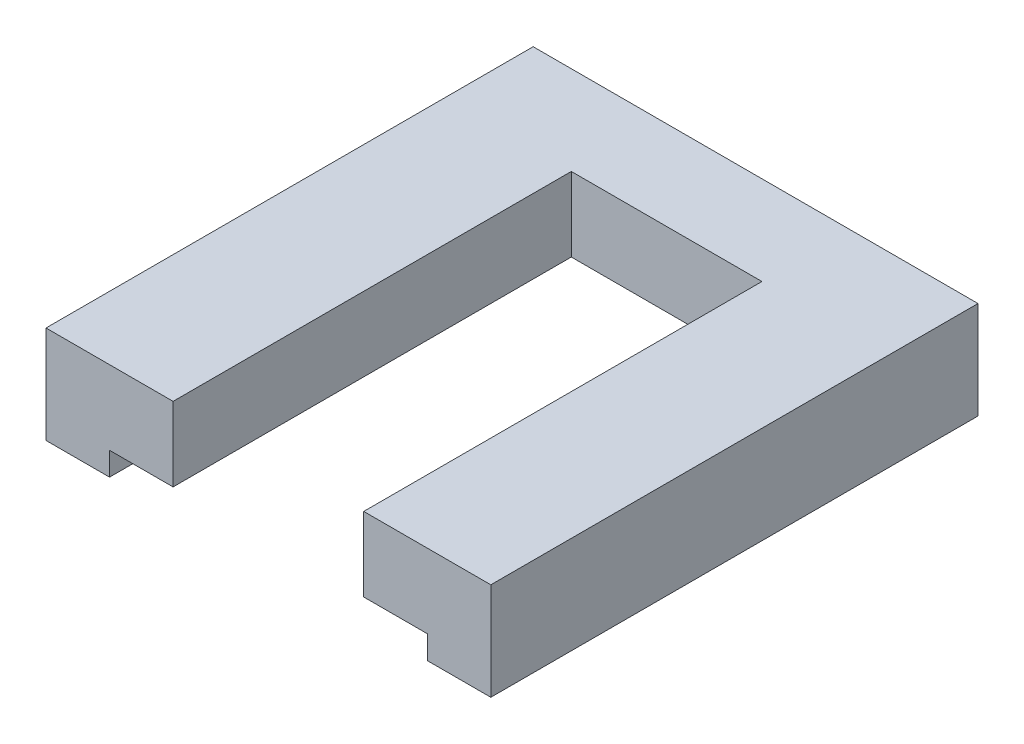
ISO-10303-21;
HEADER;
FILE_DESCRIPTION(('STEP AP214'),'2;1');
FILE_NAME('part.step','',(''),(''),'','','');
FILE_SCHEMA(('AUTOMOTIVE_DESIGN { 1 0 10303 214 1 1 1 1 }'));
ENDSEC;
DATA;
#1=APPLICATION_CONTEXT('core data for automotive mechanical design processes');
#2=APPLICATION_PROTOCOL_DEFINITION('international standard','automotive_design',2000,#1);
#3=PRODUCT_CONTEXT('',#1,'mechanical');
#4=PRODUCT('Part','Part','',(#3));
#5=PRODUCT_RELATED_PRODUCT_CATEGORY('part','',(#4));
#6=PRODUCT_DEFINITION_FORMATION('','',#4);
#7=PRODUCT_DEFINITION_CONTEXT('part definition',#1,'design');
#8=PRODUCT_DEFINITION('design','',#6,#7);
#9=PRODUCT_DEFINITION_SHAPE('','',#8);
#10=(LENGTH_UNIT() NAMED_UNIT(*) SI_UNIT(.MILLI.,.METRE.));
#11=(NAMED_UNIT(*) PLANE_ANGLE_UNIT() SI_UNIT($,.RADIAN.));
#12=(NAMED_UNIT(*) SI_UNIT($,.STERADIAN.) SOLID_ANGLE_UNIT());
#13=UNCERTAINTY_MEASURE_WITH_UNIT(LENGTH_MEASURE(1.E-05),#10,'distance_accuracy_value','');
#14=(GEOMETRIC_REPRESENTATION_CONTEXT(3) GLOBAL_UNCERTAINTY_ASSIGNED_CONTEXT((#13)) GLOBAL_UNIT_ASSIGNED_CONTEXT((#10,
#11,#12)) REPRESENTATION_CONTEXT('',''));
#15=CARTESIAN_POINT('',(0.,0.,0.));
#16=DIRECTION('',(0.,0.,1.));
#17=DIRECTION('',(1.,0.,0.));
#18=AXIS2_PLACEMENT_3D('',#15,#16,#17);
#19=CARTESIAN_POINT('',(-11.2941176470588,1.1,0.));
#20=DIRECTION('',(1.,0.,0.));
#21=DIRECTION('',(0.,0.,-1.));
#22=AXIS2_PLACEMENT_3D('',#19,#20,#21);
#23=PLANE('',#22);
#24=DIRECTION('',(0.,0.,1.));
#25=VECTOR('',#24,1.);
#26=CARTESIAN_POINT('',(-11.2941176470588,0.,0.));
#27=LINE('',#26,#25);
#28=CARTESIAN_POINT('',(-11.2941176470588,0.,-13.5));
#29=VERTEX_POINT('',#28);
#30=CARTESIAN_POINT('',(-11.2941176470588,0.,9.5));
#31=VERTEX_POINT('',#30);
#32=EDGE_CURVE('E184',#29,#31,#27,.T.);
#33=ORIENTED_EDGE('',*,*,#32,.T.);
#34=DIRECTION('',(0.,-1.,0.));
#35=VECTOR('',#34,1.);
#36=CARTESIAN_POINT('',(-11.2941176470588,1.1,9.5));
#37=LINE('',#36,#35);
#38=CARTESIAN_POINT('',(-11.2941176470588,4.6,9.5));
#39=VERTEX_POINT('',#38);
#40=EDGE_CURVE('E11',#39,#31,#37,.T.);
#41=ORIENTED_EDGE('',*,*,#40,.F.);
#42=DIRECTION('',(0.,0.,1.));
#43=VECTOR('',#42,1.);
#44=CARTESIAN_POINT('',(-11.2941176470588,4.6,-13.5));
#45=LINE('',#44,#43);
#46=CARTESIAN_POINT('',(-11.2941176470588,4.6,-13.5));
#47=VERTEX_POINT('',#46);
#48=EDGE_CURVE('E138',#47,#39,#45,.T.);
#49=ORIENTED_EDGE('',*,*,#48,.F.);
#50=DIRECTION('',(0.,-1.,0.));
#51=VECTOR('',#50,1.);
#52=CARTESIAN_POINT('',(-11.2941176470588,1.1,-13.5));
#53=LINE('',#52,#51);
#54=EDGE_CURVE('E88',#47,#29,#53,.T.);
#55=ORIENTED_EDGE('',*,*,#54,.T.);
#56=EDGE_LOOP('',(#33,#41,#49,#55));
#57=FACE_BOUND('',#56,.T.);
#58=ADVANCED_FACE('F35',(#57),#23,.F.);
#59=CARTESIAN_POINT('',(0.,1.1,9.50000000000001));
#60=DIRECTION('',(0.,0.,-1.));
#61=DIRECTION('',(-1.,0.,0.));
#62=AXIS2_PLACEMENT_3D('',#59,#60,#61);
#63=PLANE('',#62);
#64=DIRECTION('',(1.,0.,0.));
#65=VECTOR('',#64,1.);
#66=CARTESIAN_POINT('',(0.,0.,9.50000000000001));
#67=LINE('',#66,#65);
#68=CARTESIAN_POINT('',(-8.29411764705883,0.,9.5));
#69=VERTEX_POINT('',#68);
#70=EDGE_CURVE('E193',#31,#69,#67,.T.);
#71=ORIENTED_EDGE('',*,*,#70,.T.);
#72=DIRECTION('',(0.,-1.,0.));
#73=VECTOR('',#72,1.);
#74=CARTESIAN_POINT('',(-8.29411764705883,1.1,9.5));
#75=LINE('',#74,#73);
#76=CARTESIAN_POINT('',(-8.29411764705883,1.1,9.5));
#77=VERTEX_POINT('',#76);
#78=EDGE_CURVE('E43',#77,#69,#75,.T.);
#79=ORIENTED_EDGE('',*,*,#78,.F.);
#80=DIRECTION('',(1.,0.,0.));
#81=VECTOR('',#80,1.);
#82=CARTESIAN_POINT('',(-8.29411764705883,1.1,9.5));
#83=LINE('',#82,#81);
#84=CARTESIAN_POINT('',(-5.29411764705882,1.1,9.5));
#85=VERTEX_POINT('',#84);
#86=EDGE_CURVE('E165',#77,#85,#83,.T.);
#87=ORIENTED_EDGE('',*,*,#86,.T.);
#88=DIRECTION('',(0.,-1.,0.));
#89=VECTOR('',#88,1.);
#90=CARTESIAN_POINT('',(-5.29411764705882,4.6,9.5));
#91=LINE('',#90,#89);
#92=CARTESIAN_POINT('',(-5.29411764705882,4.6,9.5));
#93=VERTEX_POINT('',#92);
#94=EDGE_CURVE('E181',#93,#85,#91,.T.);
#95=ORIENTED_EDGE('',*,*,#94,.F.);
#96=DIRECTION('',(1.,0.,0.));
#97=VECTOR('',#96,1.);
#98=CARTESIAN_POINT('',(-11.2941176470588,4.6,9.5));
#99=LINE('',#98,#97);
#100=EDGE_CURVE('E141',#39,#93,#99,.T.);
#101=ORIENTED_EDGE('',*,*,#100,.F.);
#102=ORIENTED_EDGE('',*,*,#40,.T.);
#103=EDGE_LOOP('',(#71,#79,#87,#95,#101,#102));
#104=FACE_BOUND('',#103,.T.);
#105=ADVANCED_FACE('F222',(#104),#63,.F.);
#106=CARTESIAN_POINT('',(-8.29411764705883,1.1,0.));
#107=DIRECTION('',(1.,0.,0.));
#108=DIRECTION('',(0.,0.,-1.));
#109=AXIS2_PLACEMENT_3D('',#106,#107,#108);
#110=PLANE('',#109);
#111=DIRECTION('',(0.,0.,1.));
#112=VECTOR('',#111,1.);
#113=CARTESIAN_POINT('',(-8.29411764705883,0.,0.));
#114=LINE('',#113,#112);
#115=CARTESIAN_POINT('',(-8.29411764705883,0.,-10.5));
#116=VERTEX_POINT('',#115);
#117=EDGE_CURVE('E195',#116,#69,#114,.T.);
#118=ORIENTED_EDGE('',*,*,#117,.F.);
#119=DIRECTION('',(0.,-1.,0.));
#120=VECTOR('',#119,1.);
#121=CARTESIAN_POINT('',(-8.29411764705883,1.1,-10.5));
#122=LINE('',#121,#120);
#123=CARTESIAN_POINT('',(-8.29411764705883,1.1,-10.5));
#124=VERTEX_POINT('',#123);
#125=EDGE_CURVE('E216',#124,#116,#122,.T.);
#126=ORIENTED_EDGE('',*,*,#125,.F.);
#127=DIRECTION('',(0.,0.,1.));
#128=VECTOR('',#127,1.);
#129=CARTESIAN_POINT('',(-8.29411764705883,1.1,0.));
#130=LINE('',#129,#128);
#131=EDGE_CURVE('E185',#124,#77,#130,.T.);
#132=ORIENTED_EDGE('',*,*,#131,.T.);
#133=ORIENTED_EDGE('',*,*,#78,.T.);
#134=EDGE_LOOP('',(#118,#126,#132,#133));
#135=FACE_BOUND('',#134,.T.);
#136=ADVANCED_FACE('F219',(#135),#110,.T.);
#137=CARTESIAN_POINT('',(0.,1.1,-10.5));
#138=DIRECTION('',(0.,0.,-1.));
#139=DIRECTION('',(-1.,0.,0.));
#140=AXIS2_PLACEMENT_3D('',#137,#138,#139);
#141=PLANE('',#140);
#142=DIRECTION('',(1.,0.,0.));
#143=VECTOR('',#142,1.);
#144=CARTESIAN_POINT('',(0.,0.,-10.5));
#145=LINE('',#144,#143);
#146=CARTESIAN_POINT('',(6.70588235294117,0.,-10.5));
#147=VERTEX_POINT('',#146);
#148=EDGE_CURVE('E198',#116,#147,#145,.T.);
#149=ORIENTED_EDGE('',*,*,#148,.T.);
#150=DIRECTION('',(0.,-1.,0.));
#151=VECTOR('',#150,1.);
#152=CARTESIAN_POINT('',(6.70588235294117,1.1,-10.5));
#153=LINE('',#152,#151);
#154=CARTESIAN_POINT('',(6.70588235294117,1.1,-10.5));
#155=VERTEX_POINT('',#154);
#156=EDGE_CURVE('E51',#155,#147,#153,.T.);
#157=ORIENTED_EDGE('',*,*,#156,.F.);
#158=DIRECTION('',(1.,0.,0.));
#159=VECTOR('',#158,1.);
#160=CARTESIAN_POINT('',(0.,1.1,-10.5));
#161=LINE('',#160,#159);
#162=EDGE_CURVE('E187',#124,#155,#161,.T.);
#163=ORIENTED_EDGE('',*,*,#162,.F.);
#164=ORIENTED_EDGE('',*,*,#125,.T.);
#165=EDGE_LOOP('',(#149,#157,#163,#164));
#166=FACE_BOUND('',#165,.T.);
#167=ADVANCED_FACE('F228',(#166),#141,.F.);
#168=CARTESIAN_POINT('',(6.70588235294117,1.1,0.));
#169=DIRECTION('',(1.,0.,0.));
#170=DIRECTION('',(0.,0.,-1.));
#171=AXIS2_PLACEMENT_3D('',#168,#169,#170);
#172=PLANE('',#171);
#173=DIRECTION('',(0.,0.,1.));
#174=VECTOR('',#173,1.);
#175=CARTESIAN_POINT('',(6.70588235294117,0.,0.));
#176=LINE('',#175,#174);
#177=CARTESIAN_POINT('',(6.70588235294117,0.,9.5));
#178=VERTEX_POINT('',#177);
#179=EDGE_CURVE('E200',#147,#178,#176,.T.);
#180=ORIENTED_EDGE('',*,*,#179,.T.);
#181=DIRECTION('',(0.,-1.,0.));
#182=VECTOR('',#181,1.);
#183=CARTESIAN_POINT('',(6.70588235294117,1.1,9.5));
#184=LINE('',#183,#182);
#185=CARTESIAN_POINT('',(6.70588235294117,1.1,9.5));
#186=VERTEX_POINT('',#185);
#187=EDGE_CURVE('E212',#186,#178,#184,.T.);
#188=ORIENTED_EDGE('',*,*,#187,.F.);
#189=DIRECTION('',(0.,0.,1.));
#190=VECTOR('',#189,1.);
#191=CARTESIAN_POINT('',(6.70588235294117,1.1,0.));
#192=LINE('',#191,#190);
#193=EDGE_CURVE('E135',#155,#186,#192,.T.);
#194=ORIENTED_EDGE('',*,*,#193,.F.);
#195=ORIENTED_EDGE('',*,*,#156,.T.);
#196=EDGE_LOOP('',(#180,#188,#194,#195));
#197=FACE_BOUND('',#196,.T.);
#198=ADVANCED_FACE('F230',(#197),#172,.F.);
#199=CARTESIAN_POINT('',(0.,1.1,9.5));
#200=DIRECTION('',(0.,0.,-1.));
#201=DIRECTION('',(-1.,0.,0.));
#202=AXIS2_PLACEMENT_3D('',#199,#200,#201);
#203=PLANE('',#202);
#204=DIRECTION('',(1.,0.,0.));
#205=VECTOR('',#204,1.);
#206=CARTESIAN_POINT('',(0.,0.,9.5));
#207=LINE('',#206,#205);
#208=CARTESIAN_POINT('',(9.70588235294117,0.,9.5));
#209=VERTEX_POINT('',#208);
#210=EDGE_CURVE('E202',#178,#209,#207,.T.);
#211=ORIENTED_EDGE('',*,*,#210,.T.);
#212=DIRECTION('',(0.,-1.,0.));
#213=VECTOR('',#212,1.);
#214=CARTESIAN_POINT('',(9.70588235294117,1.1,9.5));
#215=LINE('',#214,#213);
#216=CARTESIAN_POINT('',(9.70588235294117,4.6,9.5));
#217=VERTEX_POINT('',#216);
#218=EDGE_CURVE('E210',#217,#209,#215,.T.);
#219=ORIENTED_EDGE('',*,*,#218,.F.);
#220=DIRECTION('',(1.,0.,0.));
#221=VECTOR('',#220,1.);
#222=CARTESIAN_POINT('',(3.70588235294118,4.6,9.5));
#223=LINE('',#222,#221);
#224=CARTESIAN_POINT('',(3.70588235294118,4.6,9.5));
#225=VERTEX_POINT('',#224);
#226=EDGE_CURVE('E161',#225,#217,#223,.T.);
#227=ORIENTED_EDGE('',*,*,#226,.F.);
#228=DIRECTION('',(0.,-1.,0.));
#229=VECTOR('',#228,1.);
#230=CARTESIAN_POINT('',(3.70588235294118,4.6,9.5));
#231=LINE('',#230,#229);
#232=CARTESIAN_POINT('',(3.70588235294118,1.1,9.5));
#233=VERTEX_POINT('',#232);
#234=EDGE_CURVE('E164',#225,#233,#231,.T.);
#235=ORIENTED_EDGE('',*,*,#234,.T.);
#236=DIRECTION('',(1.,0.,0.));
#237=VECTOR('',#236,1.);
#238=CARTESIAN_POINT('',(6.70588235294117,1.1,9.5));
#239=LINE('',#238,#237);
#240=EDGE_CURVE('E148',#233,#186,#239,.T.);
#241=ORIENTED_EDGE('',*,*,#240,.T.);
#242=ORIENTED_EDGE('',*,*,#187,.T.);
#243=EDGE_LOOP('',(#211,#219,#227,#235,#241,#242));
#244=FACE_BOUND('',#243,.T.);
#245=ADVANCED_FACE('F251',(#244),#203,.F.);
#246=CARTESIAN_POINT('',(9.70588235294117,1.1,0.));
#247=DIRECTION('',(1.,0.,0.));
#248=DIRECTION('',(0.,0.,-1.));
#249=AXIS2_PLACEMENT_3D('',#246,#247,#248);
#250=PLANE('',#249);
#251=DIRECTION('',(0.,0.,1.));
#252=VECTOR('',#251,1.);
#253=CARTESIAN_POINT('',(9.70588235294117,0.,0.));
#254=LINE('',#253,#252);
#255=CARTESIAN_POINT('',(9.70588235294117,0.,-13.5));
#256=VERTEX_POINT('',#255);
#257=EDGE_CURVE('E205',#256,#209,#254,.T.);
#258=ORIENTED_EDGE('',*,*,#257,.F.);
#259=DIRECTION('',(0.,-1.,0.));
#260=VECTOR('',#259,1.);
#261=CARTESIAN_POINT('',(9.70588235294117,1.1,-13.5));
#262=LINE('',#261,#260);
#263=CARTESIAN_POINT('',(9.70588235294117,4.6,-13.5));
#264=VERTEX_POINT('',#263);
#265=EDGE_CURVE('E81',#264,#256,#262,.T.);
#266=ORIENTED_EDGE('',*,*,#265,.F.);
#267=DIRECTION('',(0.,0.,-1.));
#268=VECTOR('',#267,1.);
#269=CARTESIAN_POINT('',(9.70588235294117,4.6,9.5));
#270=LINE('',#269,#268);
#271=EDGE_CURVE('E147',#217,#264,#270,.T.);
#272=ORIENTED_EDGE('',*,*,#271,.F.);
#273=ORIENTED_EDGE('',*,*,#218,.T.);
#274=EDGE_LOOP('',(#258,#266,#272,#273));
#275=FACE_BOUND('',#274,.T.);
#276=ADVANCED_FACE('F253',(#275),#250,.T.);
#277=CARTESIAN_POINT('',(0.,1.1,-13.5));
#278=DIRECTION('',(0.,0.,-1.));
#279=DIRECTION('',(-1.,0.,0.));
#280=AXIS2_PLACEMENT_3D('',#277,#278,#279);
#281=PLANE('',#280);
#282=DIRECTION('',(1.,0.,0.));
#283=VECTOR('',#282,1.);
#284=CARTESIAN_POINT('',(0.,0.,-13.5));
#285=LINE('',#284,#283);
#286=EDGE_CURVE('E134',#29,#256,#285,.T.);
#287=ORIENTED_EDGE('',*,*,#286,.F.);
#288=ORIENTED_EDGE('',*,*,#54,.F.);
#289=DIRECTION('',(-1.,0.,0.));
#290=VECTOR('',#289,1.);
#291=CARTESIAN_POINT('',(9.70588235294117,4.6,-13.5));
#292=LINE('',#291,#290);
#293=EDGE_CURVE('E132',#264,#47,#292,.T.);
#294=ORIENTED_EDGE('',*,*,#293,.F.);
#295=ORIENTED_EDGE('',*,*,#265,.T.);
#296=EDGE_LOOP('',(#287,#288,#294,#295));
#297=FACE_BOUND('',#296,.T.);
#298=ADVANCED_FACE('F130',(#297),#281,.T.);
#299=CARTESIAN_POINT('',(0.,0.,0.));
#300=DIRECTION('',(0.,1.,0.));
#301=DIRECTION('',(0.,0.,1.));
#302=AXIS2_PLACEMENT_3D('',#299,#300,#301);
#303=PLANE('',#302);
#304=ORIENTED_EDGE('',*,*,#32,.F.);
#305=ORIENTED_EDGE('',*,*,#286,.T.);
#306=ORIENTED_EDGE('',*,*,#257,.T.);
#307=ORIENTED_EDGE('',*,*,#210,.F.);
#308=ORIENTED_EDGE('',*,*,#179,.F.);
#309=ORIENTED_EDGE('',*,*,#148,.F.);
#310=ORIENTED_EDGE('',*,*,#117,.T.);
#311=ORIENTED_EDGE('',*,*,#70,.F.);
#312=EDGE_LOOP('',(#304,#305,#306,#307,#308,#309,#310,#311));
#313=FACE_BOUND('',#312,.T.);
#314=ADVANCED_FACE('F225',(#313),#303,.F.);
#315=CARTESIAN_POINT('',(-5.29411764705882,4.6,9.5));
#316=DIRECTION('',(-1.,0.,0.));
#317=DIRECTION('',(0.,0.,1.));
#318=AXIS2_PLACEMENT_3D('',#315,#316,#317);
#319=PLANE('',#318);
#320=DIRECTION('',(0.,0.,-1.));
#321=VECTOR('',#320,1.);
#322=CARTESIAN_POINT('',(-5.29411764705882,1.1,9.5));
#323=LINE('',#322,#321);
#324=CARTESIAN_POINT('',(-5.29411764705882,1.1,-9.3));
#325=VERTEX_POINT('',#324);
#326=EDGE_CURVE('E167',#85,#325,#323,.T.);
#327=ORIENTED_EDGE('',*,*,#326,.T.);
#328=DIRECTION('',(0.,-1.,0.));
#329=VECTOR('',#328,1.);
#330=CARTESIAN_POINT('',(-5.29411764705882,4.6,-9.3));
#331=LINE('',#330,#329);
#332=CARTESIAN_POINT('',(-5.29411764705882,4.6,-9.3));
#333=VERTEX_POINT('',#332);
#334=EDGE_CURVE('E178',#333,#325,#331,.T.);
#335=ORIENTED_EDGE('',*,*,#334,.F.);
#336=DIRECTION('',(0.,0.,-1.));
#337=VECTOR('',#336,1.);
#338=CARTESIAN_POINT('',(-5.29411764705882,4.6,9.5));
#339=LINE('',#338,#337);
#340=EDGE_CURVE('E155',#93,#333,#339,.T.);
#341=ORIENTED_EDGE('',*,*,#340,.F.);
#342=ORIENTED_EDGE('',*,*,#94,.T.);
#343=EDGE_LOOP('',(#327,#335,#341,#342));
#344=FACE_BOUND('',#343,.T.);
#345=ADVANCED_FACE('F238',(#344),#319,.F.);
#346=CARTESIAN_POINT('',(-5.29411764705882,4.6,-9.3));
#347=DIRECTION('',(0.,0.,-1.));
#348=DIRECTION('',(-1.,0.,0.));
#349=AXIS2_PLACEMENT_3D('',#346,#347,#348);
#350=PLANE('',#349);
#351=DIRECTION('',(1.,0.,0.));
#352=VECTOR('',#351,1.);
#353=CARTESIAN_POINT('',(-5.29411764705882,1.1,-9.3));
#354=LINE('',#353,#352);
#355=CARTESIAN_POINT('',(3.70588235294118,1.1,-9.3));
#356=VERTEX_POINT('',#355);
#357=EDGE_CURVE('E169',#325,#356,#354,.T.);
#358=ORIENTED_EDGE('',*,*,#357,.T.);
#359=DIRECTION('',(0.,-1.,0.));
#360=VECTOR('',#359,1.);
#361=CARTESIAN_POINT('',(3.70588235294118,4.6,-9.3));
#362=LINE('',#361,#360);
#363=CARTESIAN_POINT('',(3.70588235294118,4.6,-9.3));
#364=VERTEX_POINT('',#363);
#365=EDGE_CURVE('E175',#364,#356,#362,.T.);
#366=ORIENTED_EDGE('',*,*,#365,.F.);
#367=DIRECTION('',(1.,0.,0.));
#368=VECTOR('',#367,1.);
#369=CARTESIAN_POINT('',(-5.29411764705882,4.6,-9.3));
#370=LINE('',#369,#368);
#371=EDGE_CURVE('E157',#333,#364,#370,.T.);
#372=ORIENTED_EDGE('',*,*,#371,.F.);
#373=ORIENTED_EDGE('',*,*,#334,.T.);
#374=EDGE_LOOP('',(#358,#366,#372,#373));
#375=FACE_BOUND('',#374,.T.);
#376=ADVANCED_FACE('F245',(#375),#350,.F.);
#377=CARTESIAN_POINT('',(3.70588235294118,4.6,-9.3));
#378=DIRECTION('',(1.,0.,0.));
#379=DIRECTION('',(0.,0.,-1.));
#380=AXIS2_PLACEMENT_3D('',#377,#378,#379);
#381=PLANE('',#380);
#382=DIRECTION('',(0.,0.,1.));
#383=VECTOR('',#382,1.);
#384=CARTESIAN_POINT('',(3.70588235294118,1.1,-9.3));
#385=LINE('',#384,#383);
#386=EDGE_CURVE('E151',#356,#233,#385,.T.);
#387=ORIENTED_EDGE('',*,*,#386,.T.);
#388=ORIENTED_EDGE('',*,*,#234,.F.);
#389=DIRECTION('',(0.,0.,1.));
#390=VECTOR('',#389,1.);
#391=CARTESIAN_POINT('',(3.70588235294118,4.6,-9.3));
#392=LINE('',#391,#390);
#393=EDGE_CURVE('E159',#364,#225,#392,.T.);
#394=ORIENTED_EDGE('',*,*,#393,.F.);
#395=ORIENTED_EDGE('',*,*,#365,.T.);
#396=EDGE_LOOP('',(#387,#388,#394,#395));
#397=FACE_BOUND('',#396,.T.);
#398=ADVANCED_FACE('F248',(#397),#381,.F.);
#399=CARTESIAN_POINT('',(0.,4.6,0.));
#400=DIRECTION('',(0.,1.,0.));
#401=DIRECTION('',(0.,0.,1.));
#402=AXIS2_PLACEMENT_3D('',#399,#400,#401);
#403=PLANE('',#402);
#404=ORIENTED_EDGE('',*,*,#293,.T.);
#405=ORIENTED_EDGE('',*,*,#48,.T.);
#406=ORIENTED_EDGE('',*,*,#100,.T.);
#407=ORIENTED_EDGE('',*,*,#340,.T.);
#408=ORIENTED_EDGE('',*,*,#371,.T.);
#409=ORIENTED_EDGE('',*,*,#393,.T.);
#410=ORIENTED_EDGE('',*,*,#226,.T.);
#411=ORIENTED_EDGE('',*,*,#271,.T.);
#412=EDGE_LOOP('',(#404,#405,#406,#407,#408,#409,#410,#411));
#413=FACE_BOUND('',#412,.T.);
#414=ADVANCED_FACE('F144',(#413),#403,.T.);
#415=CARTESIAN_POINT('',(0.,1.1,0.));
#416=DIRECTION('',(0.,1.,0.));
#417=DIRECTION('',(0.,0.,1.));
#418=AXIS2_PLACEMENT_3D('',#415,#416,#417);
#419=PLANE('',#418);
#420=ORIENTED_EDGE('',*,*,#131,.F.);
#421=ORIENTED_EDGE('',*,*,#162,.T.);
#422=ORIENTED_EDGE('',*,*,#193,.T.);
#423=ORIENTED_EDGE('',*,*,#240,.F.);
#424=ORIENTED_EDGE('',*,*,#386,.F.);
#425=ORIENTED_EDGE('',*,*,#357,.F.);
#426=ORIENTED_EDGE('',*,*,#326,.F.);
#427=ORIENTED_EDGE('',*,*,#86,.F.);
#428=EDGE_LOOP('',(#420,#421,#422,#423,#424,#425,#426,#427));
#429=FACE_BOUND('',#428,.T.);
#430=ADVANCED_FACE('F232',(#429),#419,.F.);
#431=CLOSED_SHELL('',(#58,#105,#136,#167,#198,#245,#276,#298,#314,#345,#376,#398,#414,#430));
#432=MANIFOLD_SOLID_BREP('B2',#431);
#433=ADVANCED_BREP_SHAPE_REPRESENTATION('',(#18,#432),#14);
#434=SHAPE_DEFINITION_REPRESENTATION(#9,#433);
ENDSEC;
END-ISO-10303-21;
